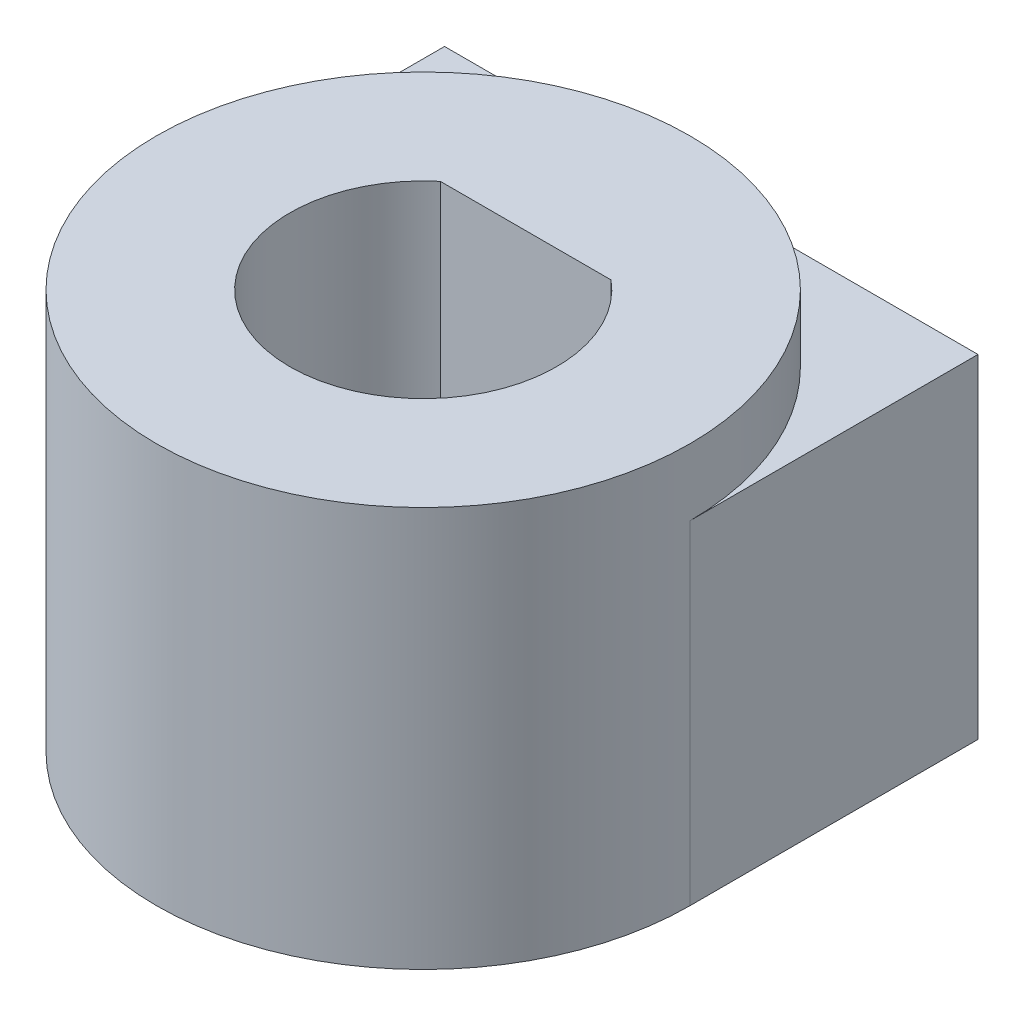
ISO-10303-21;
HEADER;
FILE_DESCRIPTION(('STEP AP214'),'2;1');
FILE_NAME('part.step','',(''),(''),'','','');
FILE_SCHEMA(('AUTOMOTIVE_DESIGN { 1 0 10303 214 1 1 1 1 }'));
ENDSEC;
DATA;
#1=APPLICATION_CONTEXT('core data for automotive mechanical design processes');
#2=APPLICATION_PROTOCOL_DEFINITION('international standard','automotive_design',2000,#1);
#3=PRODUCT_CONTEXT('',#1,'mechanical');
#4=PRODUCT('Part','Part','',(#3));
#5=PRODUCT_RELATED_PRODUCT_CATEGORY('part','',(#4));
#6=PRODUCT_DEFINITION_FORMATION('','',#4);
#7=PRODUCT_DEFINITION_CONTEXT('part definition',#1,'design');
#8=PRODUCT_DEFINITION('design','',#6,#7);
#9=PRODUCT_DEFINITION_SHAPE('','',#8);
#10=(LENGTH_UNIT() NAMED_UNIT(*) SI_UNIT(.MILLI.,.METRE.));
#11=(NAMED_UNIT(*) PLANE_ANGLE_UNIT() SI_UNIT($,.RADIAN.));
#12=(NAMED_UNIT(*) SI_UNIT($,.STERADIAN.) SOLID_ANGLE_UNIT());
#13=UNCERTAINTY_MEASURE_WITH_UNIT(LENGTH_MEASURE(1.E-05),#10,'distance_accuracy_value','');
#14=(GEOMETRIC_REPRESENTATION_CONTEXT(3) GLOBAL_UNCERTAINTY_ASSIGNED_CONTEXT((#13)) GLOBAL_UNIT_ASSIGNED_CONTEXT((#10,
#11,#12)) REPRESENTATION_CONTEXT('',''));
#15=CARTESIAN_POINT('',(0.,0.,0.));
#16=DIRECTION('',(0.,0.,1.));
#17=DIRECTION('',(1.,0.,0.));
#18=AXIS2_PLACEMENT_3D('',#15,#16,#17);
#19=CARTESIAN_POINT('',(0.,7.9375,0.));
#20=DIRECTION('',(0.,-1.,0.));
#21=DIRECTION('',(0.,0.,-1.));
#22=AXIS2_PLACEMENT_3D('',#19,#20,#21);
#23=CYLINDRICAL_SURFACE('',#22,6.35);
#24=CARTESIAN_POINT('',(0.,0.,0.));
#25=DIRECTION('',(0.,1.,0.));
#26=DIRECTION('',(0.,0.,1.));
#27=AXIS2_PLACEMENT_3D('',#24,#25,#26);
#28=CIRCLE('',#27,6.35);
#29=CARTESIAN_POINT('',(-6.35,0.,0.));
#30=VERTEX_POINT('',#29);
#31=CARTESIAN_POINT('',(6.35,0.,0.));
#32=VERTEX_POINT('',#31);
#33=EDGE_CURVE('E163',#30,#32,#28,.T.);
#34=ORIENTED_EDGE('',*,*,#33,.T.);
#35=DIRECTION('',(0.,-1.,0.));
#36=VECTOR('',#35,1.);
#37=CARTESIAN_POINT('',(6.35,7.9375,0.));
#38=LINE('',#37,#36);
#39=CARTESIAN_POINT('',(6.35,7.9375,0.));
#40=VERTEX_POINT('',#39);
#41=EDGE_CURVE('E11',#40,#32,#38,.T.);
#42=ORIENTED_EDGE('',*,*,#41,.F.);
#43=CARTESIAN_POINT('',(0.,7.9375,0.));
#44=DIRECTION('',(0.,1.,0.));
#45=DIRECTION('',(0.,0.,1.));
#46=AXIS2_PLACEMENT_3D('',#43,#44,#45);
#47=CIRCLE('',#46,6.35);
#48=CARTESIAN_POINT('',(-6.35,7.9375,0.));
#49=VERTEX_POINT('',#48);
#50=EDGE_CURVE('E122',#40,#49,#47,.T.);
#51=ORIENTED_EDGE('',*,*,#50,.T.);
#52=DIRECTION('',(0.,-1.,0.));
#53=VECTOR('',#52,1.);
#54=CARTESIAN_POINT('',(-6.35,7.9375,0.));
#55=LINE('',#54,#53);
#56=EDGE_CURVE('E61',#49,#30,#55,.T.);
#57=ORIENTED_EDGE('',*,*,#56,.T.);
#58=EDGE_LOOP('',(#34,#42,#51,#57));
#59=FACE_BOUND('',#58,.T.);
#60=CARTESIAN_POINT('',(0.,9.525,0.));
#61=DIRECTION('',(0.,1.,0.));
#62=DIRECTION('',(0.,0.,1.));
#63=AXIS2_PLACEMENT_3D('',#60,#61,#62);
#64=CIRCLE('',#63,6.35);
#65=CARTESIAN_POINT('',(0.,9.525,6.35));
#66=VERTEX_POINT('',#65);
#67=EDGE_CURVE('E128',#66,#66,#64,.T.);
#68=ORIENTED_EDGE('',*,*,#67,.F.);
#69=EDGE_LOOP('',(#68));
#70=FACE_BOUND('',#69,.T.);
#71=ADVANCED_FACE('F41',(#59,#70),#23,.T.);
#72=CARTESIAN_POINT('',(6.35,7.9375,0.));
#73=DIRECTION('',(-1.,0.,0.));
#74=DIRECTION('',(0.,0.,1.));
#75=AXIS2_PLACEMENT_3D('',#72,#73,#74);
#76=PLANE('',#75);
#77=DIRECTION('',(0.,0.,-1.));
#78=VECTOR('',#77,1.);
#79=CARTESIAN_POINT('',(6.35,0.,0.));
#80=LINE('',#79,#78);
#81=CARTESIAN_POINT('',(6.35,0.,-6.858));
#82=VERTEX_POINT('',#81);
#83=EDGE_CURVE('E166',#32,#82,#80,.T.);
#84=ORIENTED_EDGE('',*,*,#83,.T.);
#85=DIRECTION('',(0.,-1.,0.));
#86=VECTOR('',#85,1.);
#87=CARTESIAN_POINT('',(6.35,7.9375,-6.858));
#88=LINE('',#87,#86);
#89=CARTESIAN_POINT('',(6.35,7.9375,-6.858));
#90=VERTEX_POINT('',#89);
#91=EDGE_CURVE('E52',#90,#82,#88,.T.);
#92=ORIENTED_EDGE('',*,*,#91,.F.);
#93=DIRECTION('',(0.,0.,-1.));
#94=VECTOR('',#93,1.);
#95=CARTESIAN_POINT('',(6.35,7.9375,0.));
#96=LINE('',#95,#94);
#97=EDGE_CURVE('E93',#40,#90,#96,.T.);
#98=ORIENTED_EDGE('',*,*,#97,.F.);
#99=ORIENTED_EDGE('',*,*,#41,.T.);
#100=EDGE_LOOP('',(#84,#92,#98,#99));
#101=FACE_BOUND('',#100,.T.);
#102=ADVANCED_FACE('F201',(#101),#76,.F.);
#103=CARTESIAN_POINT('',(0.,7.9375,-6.858));
#104=DIRECTION('',(0.,0.,1.));
#105=DIRECTION('',(1.,0.,0.));
#106=AXIS2_PLACEMENT_3D('',#103,#104,#105);
#107=PLANE('',#106);
#108=CARTESIAN_POINT('',(0.,3.96875,-6.858));
#109=DIRECTION('',(0.,0.,-1.));
#110=DIRECTION('',(-1.,0.,0.));
#111=AXIS2_PLACEMENT_3D('',#108,#109,#110);
#112=CIRCLE('',#111,2.7559);
#113=CARTESIAN_POINT('',(-2.7559,3.96875,-6.858));
#114=VERTEX_POINT('',#113);
#115=EDGE_CURVE('E142',#114,#114,#112,.T.);
#116=ORIENTED_EDGE('',*,*,#115,.F.);
#117=EDGE_LOOP('',(#116));
#118=FACE_BOUND('',#117,.T.);
#119=DIRECTION('',(-1.,0.,0.));
#120=VECTOR('',#119,1.);
#121=CARTESIAN_POINT('',(0.,0.,-6.858));
#122=LINE('',#121,#120);
#123=CARTESIAN_POINT('',(-6.35,0.,-6.858));
#124=VERTEX_POINT('',#123);
#125=EDGE_CURVE('E169',#82,#124,#122,.T.);
#126=ORIENTED_EDGE('',*,*,#125,.T.);
#127=DIRECTION('',(0.,-1.,0.));
#128=VECTOR('',#127,1.);
#129=CARTESIAN_POINT('',(-6.35,7.9375,-6.858));
#130=LINE('',#129,#128);
#131=CARTESIAN_POINT('',(-6.35,7.9375,-6.858));
#132=VERTEX_POINT('',#131);
#133=EDGE_CURVE('E83',#132,#124,#130,.T.);
#134=ORIENTED_EDGE('',*,*,#133,.F.);
#135=DIRECTION('',(-1.,0.,0.));
#136=VECTOR('',#135,1.);
#137=CARTESIAN_POINT('',(0.,7.9375,-6.858));
#138=LINE('',#137,#136);
#139=EDGE_CURVE('E153',#90,#132,#138,.T.);
#140=ORIENTED_EDGE('',*,*,#139,.F.);
#141=ORIENTED_EDGE('',*,*,#91,.T.);
#142=EDGE_LOOP('',(#126,#134,#140,#141));
#143=FACE_BOUND('',#142,.T.);
#144=ADVANCED_FACE('F184',(#118,#143),#107,.F.);
#145=CARTESIAN_POINT('',(0.,7.9375,-2.43959033446192));
#146=DIRECTION('',(0.,0.,-1.));
#147=DIRECTION('',(-1.,0.,0.));
#148=AXIS2_PLACEMENT_3D('',#145,#146,#147);
#149=PLANE('',#148);
#150=CARTESIAN_POINT('',(0.,3.96875,-2.43959033446191));
#151=DIRECTION('',(0.,0.,-1.));
#152=DIRECTION('',(-1.,0.,0.));
#153=AXIS2_PLACEMENT_3D('',#150,#151,#152);
#154=CIRCLE('',#153,1.7526);
#155=CARTESIAN_POINT('',(-1.7526,3.96875,-2.43959033446191));
#156=VERTEX_POINT('',#155);
#157=EDGE_CURVE('E138',#156,#156,#154,.F.);
#158=ORIENTED_EDGE('',*,*,#157,.F.);
#159=EDGE_LOOP('',(#158));
#160=FACE_BOUND('',#159,.T.);
#161=DIRECTION('',(1.,0.,0.));
#162=VECTOR('',#161,1.);
#163=CARTESIAN_POINT('',(0.,0.,-2.43959033446192));
#164=LINE('',#163,#162);
#165=CARTESIAN_POINT('',(-2.032,0.,-2.43959033446192));
#166=VERTEX_POINT('',#165);
#167=CARTESIAN_POINT('',(2.032,0.,-2.43959033446192));
#168=VERTEX_POINT('',#167);
#169=EDGE_CURVE('E147',#166,#168,#164,.T.);
#170=ORIENTED_EDGE('',*,*,#169,.T.);
#171=DIRECTION('',(0.,-1.,0.));
#172=VECTOR('',#171,1.);
#173=CARTESIAN_POINT('',(2.032,7.9375,-2.43959033446192));
#174=LINE('',#173,#172);
#175=CARTESIAN_POINT('',(2.032,9.525,-2.43959033446192));
#176=VERTEX_POINT('',#175);
#177=EDGE_CURVE('E45',#176,#168,#174,.T.);
#178=ORIENTED_EDGE('',*,*,#177,.F.);
#179=DIRECTION('',(-1.,0.,0.));
#180=VECTOR('',#179,1.);
#181=CARTESIAN_POINT('',(-2.032,9.525,-2.43959033446191));
#182=LINE('',#181,#180);
#183=CARTESIAN_POINT('',(-2.032,9.525,-2.43959033446191));
#184=VERTEX_POINT('',#183);
#185=EDGE_CURVE('E119',#176,#184,#182,.T.);
#186=ORIENTED_EDGE('',*,*,#185,.T.);
#187=DIRECTION('',(0.,-1.,0.));
#188=VECTOR('',#187,1.);
#189=CARTESIAN_POINT('',(-2.032,7.9375,-2.43959033446192));
#190=LINE('',#189,#188);
#191=EDGE_CURVE('E106',#184,#166,#190,.T.);
#192=ORIENTED_EDGE('',*,*,#191,.T.);
#193=EDGE_LOOP('',(#170,#178,#186,#192));
#194=FACE_BOUND('',#193,.T.);
#195=ADVANCED_FACE('F43',(#160,#194),#149,.F.);
#196=CARTESIAN_POINT('',(0.,7.9375,0.));
#197=DIRECTION('',(0.,-1.,0.));
#198=DIRECTION('',(0.,0.,-1.));
#199=AXIS2_PLACEMENT_3D('',#196,#197,#198);
#200=CYLINDRICAL_SURFACE('',#199,3.175);
#201=CARTESIAN_POINT('',(0.,0.,0.));
#202=DIRECTION('',(0.,1.,0.));
#203=DIRECTION('',(0.,0.,1.));
#204=AXIS2_PLACEMENT_3D('',#201,#202,#203);
#205=CIRCLE('',#204,3.175);
#206=EDGE_CURVE('E113',#166,#168,#205,.T.);
#207=ORIENTED_EDGE('',*,*,#206,.F.);
#208=ORIENTED_EDGE('',*,*,#191,.F.);
#209=CARTESIAN_POINT('',(0.,9.525,0.));
#210=DIRECTION('',(0.,1.,0.));
#211=DIRECTION('',(0.,0.,-1.));
#212=AXIS2_PLACEMENT_3D('',#209,#210,#211);
#213=CIRCLE('',#212,3.175);
#214=EDGE_CURVE('E110',#184,#176,#213,.T.);
#215=ORIENTED_EDGE('',*,*,#214,.T.);
#216=ORIENTED_EDGE('',*,*,#177,.T.);
#217=EDGE_LOOP('',(#207,#208,#215,#216));
#218=FACE_BOUND('',#217,.T.);
#219=ADVANCED_FACE('F108',(#218),#200,.F.);
#220=CARTESIAN_POINT('',(-6.35,7.9375,0.));
#221=DIRECTION('',(-1.,0.,0.));
#222=DIRECTION('',(0.,0.,1.));
#223=AXIS2_PLACEMENT_3D('',#220,#221,#222);
#224=PLANE('',#223);
#225=DIRECTION('',(0.,0.,-1.));
#226=VECTOR('',#225,1.);
#227=CARTESIAN_POINT('',(-6.35,0.,0.));
#228=LINE('',#227,#226);
#229=EDGE_CURVE('E154',#30,#124,#228,.T.);
#230=ORIENTED_EDGE('',*,*,#229,.F.);
#231=ORIENTED_EDGE('',*,*,#56,.F.);
#232=DIRECTION('',(0.,0.,-1.));
#233=VECTOR('',#232,1.);
#234=CARTESIAN_POINT('',(-6.35,7.9375,0.));
#235=LINE('',#234,#233);
#236=EDGE_CURVE('E118',#49,#132,#235,.T.);
#237=ORIENTED_EDGE('',*,*,#236,.T.);
#238=ORIENTED_EDGE('',*,*,#133,.T.);
#239=EDGE_LOOP('',(#230,#231,#237,#238));
#240=FACE_BOUND('',#239,.T.);
#241=ADVANCED_FACE('F188',(#240),#224,.T.);
#242=CARTESIAN_POINT('',(0.,7.9375,0.));
#243=DIRECTION('',(0.,1.,0.));
#244=DIRECTION('',(0.,0.,1.));
#245=AXIS2_PLACEMENT_3D('',#242,#243,#244);
#246=PLANE('',#245);
#247=ORIENTED_EDGE('',*,*,#50,.F.);
#248=ORIENTED_EDGE('',*,*,#97,.T.);
#249=ORIENTED_EDGE('',*,*,#139,.T.);
#250=ORIENTED_EDGE('',*,*,#236,.F.);
#251=EDGE_LOOP('',(#247,#248,#249,#250));
#252=FACE_BOUND('',#251,.T.);
#253=ADVANCED_FACE('F190',(#252),#246,.T.);
#254=CARTESIAN_POINT('',(0.,0.,0.));
#255=DIRECTION('',(0.,1.,0.));
#256=DIRECTION('',(0.,0.,1.));
#257=AXIS2_PLACEMENT_3D('',#254,#255,#256);
#258=PLANE('',#257);
#259=ORIENTED_EDGE('',*,*,#169,.F.);
#260=ORIENTED_EDGE('',*,*,#206,.T.);
#261=EDGE_LOOP('',(#259,#260));
#262=FACE_BOUND('',#261,.T.);
#263=ORIENTED_EDGE('',*,*,#33,.F.);
#264=ORIENTED_EDGE('',*,*,#229,.T.);
#265=ORIENTED_EDGE('',*,*,#125,.F.);
#266=ORIENTED_EDGE('',*,*,#83,.F.);
#267=EDGE_LOOP('',(#263,#264,#265,#266));
#268=FACE_BOUND('',#267,.T.);
#269=ADVANCED_FACE('F187',(#262,#268),#258,.F.);
#270=CARTESIAN_POINT('',(0.,3.96875,-3.048));
#271=DIRECTION('',(0.,0.,-1.));
#272=DIRECTION('',(-1.,0.,0.));
#273=AXIS2_PLACEMENT_3D('',#270,#271,#272);
#274=CYLINDRICAL_SURFACE('',#273,2.7559);
#275=CARTESIAN_POINT('',(0.,3.96875,-3.048));
#276=DIRECTION('',(0.,0.,-1.));
#277=DIRECTION('',(-1.,0.,0.));
#278=AXIS2_PLACEMENT_3D('',#275,#276,#277);
#279=CIRCLE('',#278,2.7559);
#280=CARTESIAN_POINT('',(-2.7559,3.96875,-3.048));
#281=VERTEX_POINT('',#280);
#282=EDGE_CURVE('E143',#281,#281,#279,.T.);
#283=ORIENTED_EDGE('',*,*,#282,.F.);
#284=EDGE_LOOP('',(#283));
#285=FACE_BOUND('',#284,.T.);
#286=ORIENTED_EDGE('',*,*,#115,.T.);
#287=EDGE_LOOP('',(#286));
#288=FACE_BOUND('',#287,.T.);
#289=ADVANCED_FACE('F217',(#285,#288),#274,.F.);
#290=CARTESIAN_POINT('',(0.,3.96875,-3.048));
#291=DIRECTION('',(0.,0.,-1.));
#292=DIRECTION('',(-1.,0.,0.));
#293=AXIS2_PLACEMENT_3D('',#290,#291,#292);
#294=PLANE('',#293);
#295=CARTESIAN_POINT('',(0.,3.96875,-3.048));
#296=DIRECTION('',(0.,0.,-1.));
#297=DIRECTION('',(-1.,0.,0.));
#298=AXIS2_PLACEMENT_3D('',#295,#296,#297);
#299=CIRCLE('',#298,1.7526);
#300=CARTESIAN_POINT('',(-1.7526,3.96875,-3.048));
#301=VERTEX_POINT('',#300);
#302=EDGE_CURVE('E132',#301,#301,#299,.T.);
#303=ORIENTED_EDGE('',*,*,#302,.F.);
#304=EDGE_LOOP('',(#303));
#305=FACE_BOUND('',#304,.T.);
#306=ORIENTED_EDGE('',*,*,#282,.T.);
#307=EDGE_LOOP('',(#306));
#308=FACE_BOUND('',#307,.T.);
#309=ADVANCED_FACE('F219',(#305,#308),#294,.T.);
#310=CARTESIAN_POINT('',(0.,3.96875,6.351));
#311=DIRECTION('',(0.,0.,-1.));
#312=DIRECTION('',(-1.,0.,0.));
#313=AXIS2_PLACEMENT_3D('',#310,#311,#312);
#314=CYLINDRICAL_SURFACE('',#313,1.7526);
#315=ORIENTED_EDGE('',*,*,#302,.T.);
#316=EDGE_LOOP('',(#315));
#317=FACE_BOUND('',#316,.T.);
#318=ORIENTED_EDGE('',*,*,#157,.T.);
#319=EDGE_LOOP('',(#318));
#320=FACE_BOUND('',#319,.T.);
#321=ADVANCED_FACE('F226',(#317,#320),#314,.F.);
#322=CARTESIAN_POINT('',(0.,9.525,0.));
#323=DIRECTION('',(0.,1.,0.));
#324=DIRECTION('',(0.,0.,1.));
#325=AXIS2_PLACEMENT_3D('',#322,#323,#324);
#326=PLANE('',#325);
#327=ORIENTED_EDGE('',*,*,#67,.T.);
#328=EDGE_LOOP('',(#327));
#329=FACE_BOUND('',#328,.T.);
#330=ORIENTED_EDGE('',*,*,#185,.F.);
#331=ORIENTED_EDGE('',*,*,#214,.F.);
#332=EDGE_LOOP('',(#330,#331));
#333=FACE_BOUND('',#332,.T.);
#334=ADVANCED_FACE('F124',(#329,#333),#326,.T.);
#335=CLOSED_SHELL('',(#71,#102,#144,#195,#219,#241,#253,#269,#289,#309,#321,#334));
#336=MANIFOLD_SOLID_BREP('B2',#335);
#337=ADVANCED_BREP_SHAPE_REPRESENTATION('',(#18,#336),#14);
#338=SHAPE_DEFINITION_REPRESENTATION(#9,#337);
ENDSEC;
END-ISO-10303-21;
